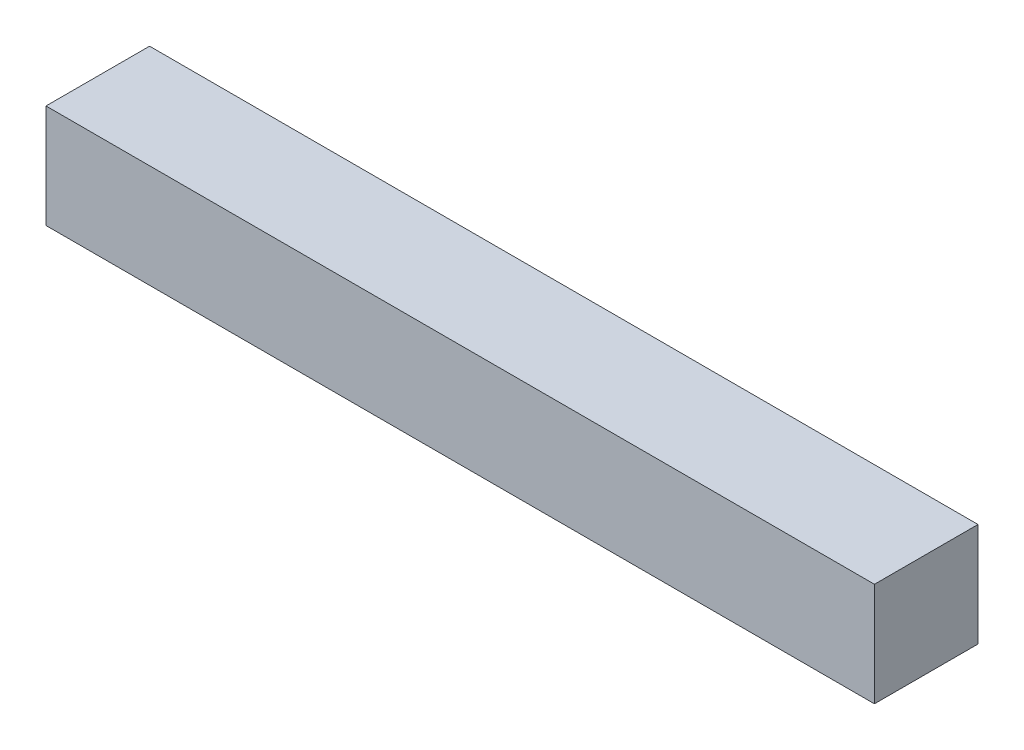
ISO-10303-21;
HEADER;
FILE_DESCRIPTION(('STEP AP214'),'2;1');
FILE_NAME('part.step','',(''),(''),'','','');
FILE_SCHEMA(('AUTOMOTIVE_DESIGN { 1 0 10303 214 1 1 1 1 }'));
ENDSEC;
DATA;
#1=APPLICATION_CONTEXT('core data for automotive mechanical design processes');
#2=APPLICATION_PROTOCOL_DEFINITION('international standard','automotive_design',2000,#1);
#3=PRODUCT_CONTEXT('',#1,'mechanical');
#4=PRODUCT('Part','Part','',(#3));
#5=PRODUCT_RELATED_PRODUCT_CATEGORY('part','',(#4));
#6=PRODUCT_DEFINITION_FORMATION('','',#4);
#7=PRODUCT_DEFINITION_CONTEXT('part definition',#1,'design');
#8=PRODUCT_DEFINITION('design','',#6,#7);
#9=PRODUCT_DEFINITION_SHAPE('','',#8);
#10=(LENGTH_UNIT() NAMED_UNIT(*) SI_UNIT(.MILLI.,.METRE.));
#11=(NAMED_UNIT(*) PLANE_ANGLE_UNIT() SI_UNIT($,.RADIAN.));
#12=(NAMED_UNIT(*) SI_UNIT($,.STERADIAN.) SOLID_ANGLE_UNIT());
#13=UNCERTAINTY_MEASURE_WITH_UNIT(LENGTH_MEASURE(1.E-05),#10,'distance_accuracy_value','');
#14=(GEOMETRIC_REPRESENTATION_CONTEXT(3) GLOBAL_UNCERTAINTY_ASSIGNED_CONTEXT((#13)) GLOBAL_UNIT_ASSIGNED_CONTEXT((#10,
#11,#12)) REPRESENTATION_CONTEXT('',''));
#15=CARTESIAN_POINT('',(0.,0.,0.));
#16=DIRECTION('',(0.,0.,1.));
#17=DIRECTION('',(1.,0.,0.));
#18=AXIS2_PLACEMENT_3D('',#15,#16,#17);
#19=CARTESIAN_POINT('',(-12.7,-3.175,-1.5875));
#20=DIRECTION('',(-1.,0.,0.));
#21=DIRECTION('',(0.,0.,1.));
#22=AXIS2_PLACEMENT_3D('',#19,#20,#21);
#23=PLANE('',#22);
#24=DIRECTION('',(0.,0.,1.));
#25=VECTOR('',#24,1.);
#26=CARTESIAN_POINT('',(-12.7,0.,-1.5875));
#27=LINE('',#26,#25);
#28=CARTESIAN_POINT('',(-12.7,0.,-1.5875));
#29=VERTEX_POINT('',#28);
#30=CARTESIAN_POINT('',(-12.7,0.,1.5875));
#31=VERTEX_POINT('',#30);
#32=EDGE_CURVE('E96',#29,#31,#27,.T.);
#33=ORIENTED_EDGE('',*,*,#32,.F.);
#34=DIRECTION('',(0.,1.,0.));
#35=VECTOR('',#34,1.);
#36=CARTESIAN_POINT('',(-12.7,-3.175,-1.5875));
#37=LINE('',#36,#35);
#38=CARTESIAN_POINT('',(-12.7,-3.175,-1.5875));
#39=VERTEX_POINT('',#38);
#40=EDGE_CURVE('E11',#39,#29,#37,.T.);
#41=ORIENTED_EDGE('',*,*,#40,.F.);
#42=DIRECTION('',(0.,0.,1.));
#43=VECTOR('',#42,1.);
#44=CARTESIAN_POINT('',(-12.7,-3.175,-1.5875));
#45=LINE('',#44,#43);
#46=CARTESIAN_POINT('',(-12.7,-3.175,1.5875));
#47=VERTEX_POINT('',#46);
#48=EDGE_CURVE('E90',#39,#47,#45,.T.);
#49=ORIENTED_EDGE('',*,*,#48,.T.);
#50=DIRECTION('',(0.,1.,0.));
#51=VECTOR('',#50,1.);
#52=CARTESIAN_POINT('',(-12.7,-3.175,1.5875));
#53=LINE('',#52,#51);
#54=EDGE_CURVE('E35',#47,#31,#53,.T.);
#55=ORIENTED_EDGE('',*,*,#54,.T.);
#56=EDGE_LOOP('',(#33,#41,#49,#55));
#57=FACE_BOUND('',#56,.T.);
#58=ADVANCED_FACE('F32',(#57),#23,.T.);
#59=CARTESIAN_POINT('',(-12.7,-3.175,-1.5875));
#60=DIRECTION('',(0.,0.,-1.));
#61=DIRECTION('',(-1.,0.,0.));
#62=AXIS2_PLACEMENT_3D('',#59,#60,#61);
#63=PLANE('',#62);
#64=DIRECTION('',(-1.,0.,0.));
#65=VECTOR('',#64,1.);
#66=CARTESIAN_POINT('',(-12.7,0.,-1.5875));
#67=LINE('',#66,#65);
#68=CARTESIAN_POINT('',(12.7,0.,-1.5875));
#69=VERTEX_POINT('',#68);
#70=EDGE_CURVE('E92',#69,#29,#67,.T.);
#71=ORIENTED_EDGE('',*,*,#70,.F.);
#72=DIRECTION('',(0.,1.,0.));
#73=VECTOR('',#72,1.);
#74=CARTESIAN_POINT('',(12.7,-3.175,-1.5875));
#75=LINE('',#74,#73);
#76=CARTESIAN_POINT('',(12.7,-3.175,-1.5875));
#77=VERTEX_POINT('',#76);
#78=EDGE_CURVE('E41',#77,#69,#75,.T.);
#79=ORIENTED_EDGE('',*,*,#78,.F.);
#80=DIRECTION('',(-1.,0.,0.));
#81=VECTOR('',#80,1.);
#82=CARTESIAN_POINT('',(-12.7,-3.175,-1.5875));
#83=LINE('',#82,#81);
#84=EDGE_CURVE('E87',#77,#39,#83,.T.);
#85=ORIENTED_EDGE('',*,*,#84,.T.);
#86=ORIENTED_EDGE('',*,*,#40,.T.);
#87=EDGE_LOOP('',(#71,#79,#85,#86));
#88=FACE_BOUND('',#87,.T.);
#89=ADVANCED_FACE('F106',(#88),#63,.T.);
#90=CARTESIAN_POINT('',(12.7,-3.175,-1.5875));
#91=DIRECTION('',(1.,0.,0.));
#92=DIRECTION('',(0.,0.,-1.));
#93=AXIS2_PLACEMENT_3D('',#90,#91,#92);
#94=PLANE('',#93);
#95=DIRECTION('',(0.,0.,-1.));
#96=VECTOR('',#95,1.);
#97=CARTESIAN_POINT('',(12.7,0.,-1.5875));
#98=LINE('',#97,#96);
#99=CARTESIAN_POINT('',(12.7,0.,1.5875));
#100=VERTEX_POINT('',#99);
#101=EDGE_CURVE('E82',#100,#69,#98,.T.);
#102=ORIENTED_EDGE('',*,*,#101,.F.);
#103=DIRECTION('',(0.,1.,0.));
#104=VECTOR('',#103,1.);
#105=CARTESIAN_POINT('',(12.7,-3.175,1.5875));
#106=LINE('',#105,#104);
#107=CARTESIAN_POINT('',(12.7,-3.175,1.5875));
#108=VERTEX_POINT('',#107);
#109=EDGE_CURVE('E77',#108,#100,#106,.T.);
#110=ORIENTED_EDGE('',*,*,#109,.F.);
#111=DIRECTION('',(0.,0.,-1.));
#112=VECTOR('',#111,1.);
#113=CARTESIAN_POINT('',(12.7,-3.175,-1.5875));
#114=LINE('',#113,#112);
#115=EDGE_CURVE('E80',#108,#77,#114,.T.);
#116=ORIENTED_EDGE('',*,*,#115,.T.);
#117=ORIENTED_EDGE('',*,*,#78,.T.);
#118=EDGE_LOOP('',(#102,#110,#116,#117));
#119=FACE_BOUND('',#118,.T.);
#120=ADVANCED_FACE('F79',(#119),#94,.T.);
#121=CARTESIAN_POINT('',(-12.7,-3.175,1.5875));
#122=DIRECTION('',(0.,0.,1.));
#123=DIRECTION('',(1.,0.,0.));
#124=AXIS2_PLACEMENT_3D('',#121,#122,#123);
#125=PLANE('',#124);
#126=DIRECTION('',(1.,0.,0.));
#127=VECTOR('',#126,1.);
#128=CARTESIAN_POINT('',(-12.7,0.,1.5875));
#129=LINE('',#128,#127);
#130=EDGE_CURVE('E99',#31,#100,#129,.T.);
#131=ORIENTED_EDGE('',*,*,#130,.F.);
#132=ORIENTED_EDGE('',*,*,#54,.F.);
#133=DIRECTION('',(1.,0.,0.));
#134=VECTOR('',#133,1.);
#135=CARTESIAN_POINT('',(-12.7,-3.175,1.5875));
#136=LINE('',#135,#134);
#137=EDGE_CURVE('E86',#47,#108,#136,.T.);
#138=ORIENTED_EDGE('',*,*,#137,.T.);
#139=ORIENTED_EDGE('',*,*,#109,.T.);
#140=EDGE_LOOP('',(#131,#132,#138,#139));
#141=FACE_BOUND('',#140,.T.);
#142=ADVANCED_FACE('F89',(#141),#125,.T.);
#143=CARTESIAN_POINT('',(-12.7,-3.175,1.5875));
#144=DIRECTION('',(0.,1.,0.));
#145=DIRECTION('',(0.,0.,1.));
#146=AXIS2_PLACEMENT_3D('',#143,#144,#145);
#147=PLANE('',#146);
#148=ORIENTED_EDGE('',*,*,#48,.F.);
#149=ORIENTED_EDGE('',*,*,#84,.F.);
#150=ORIENTED_EDGE('',*,*,#115,.F.);
#151=ORIENTED_EDGE('',*,*,#137,.F.);
#152=EDGE_LOOP('',(#148,#149,#150,#151));
#153=FACE_BOUND('',#152,.T.);
#154=ADVANCED_FACE('F85',(#153),#147,.F.);
#155=CARTESIAN_POINT('',(-12.7,0.,1.5875));
#156=DIRECTION('',(0.,1.,0.));
#157=DIRECTION('',(0.,0.,1.));
#158=AXIS2_PLACEMENT_3D('',#155,#156,#157);
#159=PLANE('',#158);
#160=ORIENTED_EDGE('',*,*,#32,.T.);
#161=ORIENTED_EDGE('',*,*,#130,.T.);
#162=ORIENTED_EDGE('',*,*,#101,.T.);
#163=ORIENTED_EDGE('',*,*,#70,.T.);
#164=EDGE_LOOP('',(#160,#161,#162,#163));
#165=FACE_BOUND('',#164,.T.);
#166=ADVANCED_FACE('F105',(#165),#159,.T.);
#167=CLOSED_SHELL('',(#58,#89,#120,#142,#154,#166));
#168=MANIFOLD_SOLID_BREP('B2',#167);
#169=ADVANCED_BREP_SHAPE_REPRESENTATION('',(#18,#168),#14);
#170=SHAPE_DEFINITION_REPRESENTATION(#9,#169);
ENDSEC;
END-ISO-10303-21;
